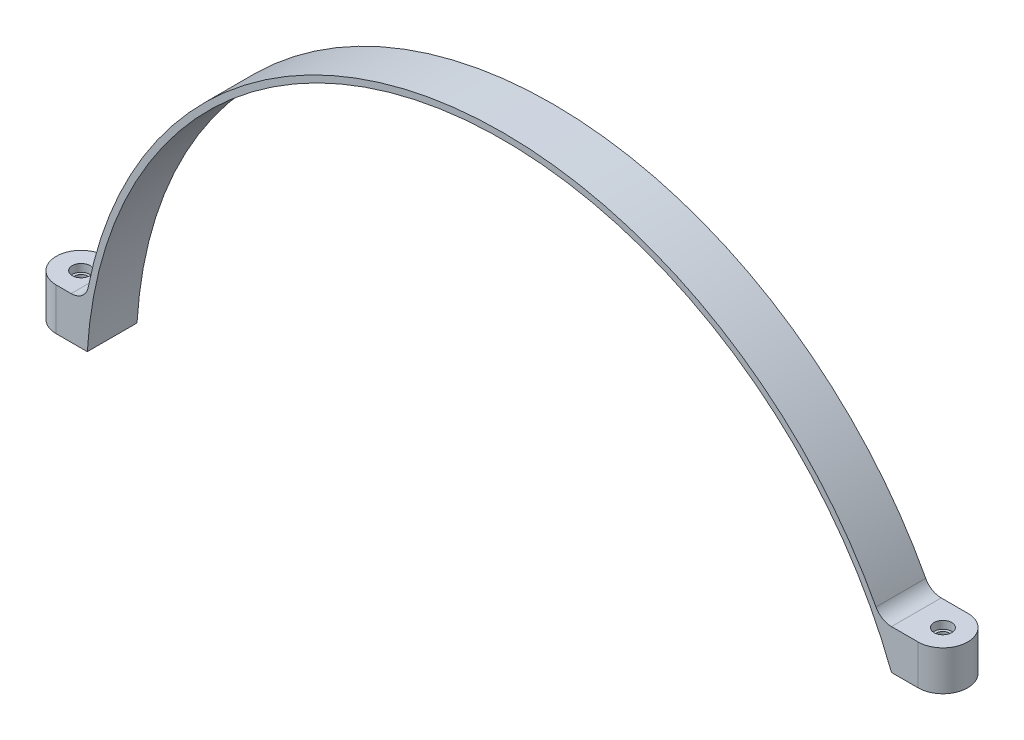
ISO-10303-21;
HEADER;
FILE_DESCRIPTION(('STEP AP214'),'2;1');
FILE_NAME('part.step','',(''),(''),'','','');
FILE_SCHEMA(('AUTOMOTIVE_DESIGN { 1 0 10303 214 1 1 1 1 }'));
ENDSEC;
DATA;
#1=APPLICATION_CONTEXT('core data for automotive mechanical design processes');
#2=APPLICATION_PROTOCOL_DEFINITION('international standard','automotive_design',2000,#1);
#3=PRODUCT_CONTEXT('',#1,'mechanical');
#4=PRODUCT('Part','Part','',(#3));
#5=PRODUCT_RELATED_PRODUCT_CATEGORY('part','',(#4));
#6=PRODUCT_DEFINITION_FORMATION('','',#4);
#7=PRODUCT_DEFINITION_CONTEXT('part definition',#1,'design');
#8=PRODUCT_DEFINITION('design','',#6,#7);
#9=PRODUCT_DEFINITION_SHAPE('','',#8);
#10=(LENGTH_UNIT() NAMED_UNIT(*) SI_UNIT(.MILLI.,.METRE.));
#11=(NAMED_UNIT(*) PLANE_ANGLE_UNIT() SI_UNIT($,.RADIAN.));
#12=(NAMED_UNIT(*) SI_UNIT($,.STERADIAN.) SOLID_ANGLE_UNIT());
#13=UNCERTAINTY_MEASURE_WITH_UNIT(LENGTH_MEASURE(1.E-05),#10,'distance_accuracy_value','');
#14=(GEOMETRIC_REPRESENTATION_CONTEXT(3) GLOBAL_UNCERTAINTY_ASSIGNED_CONTEXT((#13)) GLOBAL_UNIT_ASSIGNED_CONTEXT((#10,
#11,#12)) REPRESENTATION_CONTEXT('',''));
#15=CARTESIAN_POINT('',(0.,0.,0.));
#16=DIRECTION('',(0.,0.,1.));
#17=DIRECTION('',(1.,0.,0.));
#18=AXIS2_PLACEMENT_3D('',#15,#16,#17);
#19=CARTESIAN_POINT('',(167.08278072405,82.1,10.));
#20=DIRECTION('',(0.,-1.,0.));
#21=DIRECTION('',(0.,0.,-1.));
#22=AXIS2_PLACEMENT_3D('',#19,#20,#21);
#23=CYLINDRICAL_SURFACE('',#22,2.50000000000002);
#24=CARTESIAN_POINT('',(167.08278072405,60.,10.));
#25=DIRECTION('',(0.,-1.,0.));
#26=DIRECTION('',(0.,0.,-1.));
#27=AXIS2_PLACEMENT_3D('',#24,#25,#26);
#28=CIRCLE('',#27,2.50000000000002);
#29=CARTESIAN_POINT('',(167.08278072405,60.,7.49999999999998));
#30=VERTEX_POINT('',#29);
#31=EDGE_CURVE('E177',#30,#30,#28,.T.);
#32=ORIENTED_EDGE('',*,*,#31,.T.);
#33=EDGE_LOOP('',(#32));
#34=FACE_BOUND('',#33,.T.);
#35=CARTESIAN_POINT('',(167.08278072405,72.9,10.));
#36=DIRECTION('',(0.,1.,0.));
#37=DIRECTION('',(0.,0.,1.));
#38=AXIS2_PLACEMENT_3D('',#35,#36,#37);
#39=CIRCLE('',#38,2.50000000000002);
#40=CARTESIAN_POINT('',(167.08278072405,72.9,12.5));
#41=VERTEX_POINT('',#40);
#42=EDGE_CURVE('E45',#41,#41,#39,.F.);
#43=ORIENTED_EDGE('',*,*,#42,.F.);
#44=EDGE_LOOP('',(#43));
#45=FACE_BOUND('',#44,.T.);
#46=ADVANCED_FACE('F41',(#34,#45),#23,.F.);
#47=CARTESIAN_POINT('',(-179.705627484771,26.,10.));
#48=DIRECTION('',(0.,-1.,0.));
#49=DIRECTION('',(1.,0.,0.));
#50=AXIS2_PLACEMENT_3D('',#47,#48,#49);
#51=CYLINDRICAL_SURFACE('',#50,2.50000000000002);
#52=CARTESIAN_POINT('',(-179.705627484771,10.,10.));
#53=DIRECTION('',(0.,-1.,0.));
#54=DIRECTION('',(1.,0.,0.));
#55=AXIS2_PLACEMENT_3D('',#52,#53,#54);
#56=CIRCLE('',#55,2.50000000000002);
#57=CARTESIAN_POINT('',(-177.205627484771,10.,10.));
#58=VERTEX_POINT('',#57);
#59=EDGE_CURVE('E140',#58,#58,#56,.T.);
#60=ORIENTED_EDGE('',*,*,#59,.T.);
#61=EDGE_LOOP('',(#60));
#62=FACE_BOUND('',#61,.T.);
#63=CARTESIAN_POINT('',(-179.705627484771,23.9,10.));
#64=DIRECTION('',(0.,1.,0.));
#65=DIRECTION('',(-1.,0.,0.));
#66=AXIS2_PLACEMENT_3D('',#63,#64,#65);
#67=CIRCLE('',#66,2.50000000000002);
#68=CARTESIAN_POINT('',(-182.205627484771,23.9,10.));
#69=VERTEX_POINT('',#68);
#70=EDGE_CURVE('E160',#69,#69,#67,.F.);
#71=ORIENTED_EDGE('',*,*,#70,.F.);
#72=EDGE_LOOP('',(#71));
#73=FACE_BOUND('',#72,.T.);
#74=ADVANCED_FACE('F267',(#62,#73),#51,.F.);
#75=CARTESIAN_POINT('',(156.384941730334,60.,20.));
#76=DIRECTION('',(0.,1.,0.));
#77=DIRECTION('',(0.,0.,1.));
#78=AXIS2_PLACEMENT_3D('',#75,#76,#77);
#79=PLANE('',#78);
#80=ORIENTED_EDGE('',*,*,#31,.F.);
#81=EDGE_LOOP('',(#80));
#82=FACE_BOUND('',#81,.T.);
#83=DIRECTION('',(1.,0.,0.));
#84=VECTOR('',#83,1.);
#85=CARTESIAN_POINT('',(156.384941730334,60.,0.));
#86=LINE('',#85,#84);
#87=CARTESIAN_POINT('',(156.384941730334,60.,0.));
#88=VERTEX_POINT('',#87);
#89=CARTESIAN_POINT('',(167.08278072405,60.,0.));
#90=VERTEX_POINT('',#89);
#91=EDGE_CURVE('E197',#88,#90,#86,.T.);
#92=ORIENTED_EDGE('',*,*,#91,.T.);
#93=CARTESIAN_POINT('',(167.08278072405,60.,10.));
#94=DIRECTION('',(0.,1.,0.));
#95=DIRECTION('',(0.,0.,1.));
#96=AXIS2_PLACEMENT_3D('',#93,#94,#95);
#97=CIRCLE('',#96,10.);
#98=CARTESIAN_POINT('',(167.08278072405,60.,20.));
#99=VERTEX_POINT('',#98);
#100=EDGE_CURVE('E236',#90,#99,#97,.F.);
#101=ORIENTED_EDGE('',*,*,#100,.T.);
#102=DIRECTION('',(1.,0.,0.));
#103=VECTOR('',#102,1.);
#104=CARTESIAN_POINT('',(156.384941730334,60.,20.));
#105=LINE('',#104,#103);
#106=CARTESIAN_POINT('',(156.384941730334,60.,20.));
#107=VERTEX_POINT('',#106);
#108=EDGE_CURVE('E198',#107,#99,#105,.T.);
#109=ORIENTED_EDGE('',*,*,#108,.F.);
#110=DIRECTION('',(0.,0.,-1.));
#111=VECTOR('',#110,1.);
#112=CARTESIAN_POINT('',(156.384941730334,60.,20.));
#113=LINE('',#112,#111);
#114=EDGE_CURVE('E212',#107,#88,#113,.T.);
#115=ORIENTED_EDGE('',*,*,#114,.T.);
#116=EDGE_LOOP('',(#92,#101,#109,#115));
#117=FACE_BOUND('',#116,.T.);
#118=ADVANCED_FACE('F273',(#82,#117),#79,.F.);
#119=CARTESIAN_POINT('',(0.,0.,20.));
#120=DIRECTION('',(0.,0.,-1.));
#121=DIRECTION('',(-1.,0.,0.));
#122=AXIS2_PLACEMENT_3D('',#119,#120,#121);
#123=CYLINDRICAL_SURFACE('',#122,170.);
#124=CARTESIAN_POINT('',(0.,0.,0.));
#125=DIRECTION('',(0.,0.,1.));
#126=DIRECTION('',(1.,0.,0.));
#127=AXIS2_PLACEMENT_3D('',#124,#125,#126);
#128=CIRCLE('',#127,170.);
#129=CARTESIAN_POINT('',(150.150415787231,79.7173296022987,0.));
#130=VERTEX_POINT('',#129);
#131=CARTESIAN_POINT('',(-166.834130174155,32.6553672316384,0.));
#132=VERTEX_POINT('',#131);
#133=EDGE_CURVE('E216',#130,#132,#128,.T.);
#134=ORIENTED_EDGE('',*,*,#133,.T.);
#135=DIRECTION('',(0.,0.,-1.));
#136=VECTOR('',#135,1.);
#137=CARTESIAN_POINT('',(-166.834130174155,32.6553672316384,20.));
#138=LINE('',#137,#136);
#139=CARTESIAN_POINT('',(-166.834130174155,32.6553672316384,20.));
#140=VERTEX_POINT('',#139);
#141=EDGE_CURVE('E147',#132,#140,#138,.F.);
#142=ORIENTED_EDGE('',*,*,#141,.T.);
#143=CARTESIAN_POINT('',(0.,0.,20.));
#144=DIRECTION('',(0.,0.,1.));
#145=DIRECTION('',(1.,0.,0.));
#146=AXIS2_PLACEMENT_3D('',#143,#144,#145);
#147=CIRCLE('',#146,170.);
#148=CARTESIAN_POINT('',(150.150415787231,79.7173296022987,20.));
#149=VERTEX_POINT('',#148);
#150=EDGE_CURVE('E201',#149,#140,#147,.T.);
#151=ORIENTED_EDGE('',*,*,#150,.F.);
#152=DIRECTION('',(0.,0.,-1.));
#153=VECTOR('',#152,1.);
#154=CARTESIAN_POINT('',(150.150415787231,79.7173296022987,20.));
#155=LINE('',#154,#153);
#156=EDGE_CURVE('E145',#149,#130,#155,.T.);
#157=ORIENTED_EDGE('',*,*,#156,.T.);
#158=EDGE_LOOP('',(#134,#142,#151,#157));
#159=FACE_BOUND('',#158,.T.);
#160=ADVANCED_FACE('F252',(#159),#123,.T.);
#161=CARTESIAN_POINT('',(-189.705627484771,10.,20.));
#162=DIRECTION('',(0.,1.,0.));
#163=DIRECTION('',(-1.,0.,0.));
#164=AXIS2_PLACEMENT_3D('',#161,#162,#163);
#165=PLANE('',#164);
#166=ORIENTED_EDGE('',*,*,#59,.F.);
#167=EDGE_LOOP('',(#166));
#168=FACE_BOUND('',#167,.T.);
#169=CARTESIAN_POINT('',(-179.705627484771,10.,10.));
#170=DIRECTION('',(0.,1.,0.));
#171=DIRECTION('',(-1.,0.,0.));
#172=AXIS2_PLACEMENT_3D('',#169,#170,#171);
#173=CIRCLE('',#172,10.);
#174=CARTESIAN_POINT('',(-179.705627484771,10.,20.));
#175=VERTEX_POINT('',#174);
#176=CARTESIAN_POINT('',(-179.705627484771,10.,0.));
#177=VERTEX_POINT('',#176);
#178=EDGE_CURVE('E244',#175,#177,#173,.F.);
#179=ORIENTED_EDGE('',*,*,#178,.T.);
#180=DIRECTION('',(1.,0.,0.));
#181=VECTOR('',#180,1.);
#182=CARTESIAN_POINT('',(-189.705627484771,10.,0.));
#183=LINE('',#182,#181);
#184=CARTESIAN_POINT('',(-167.20122607206,10.,0.));
#185=VERTEX_POINT('',#184);
#186=EDGE_CURVE('E220',#177,#185,#183,.T.);
#187=ORIENTED_EDGE('',*,*,#186,.T.);
#188=DIRECTION('',(0.,0.,-1.));
#189=VECTOR('',#188,1.);
#190=CARTESIAN_POINT('',(-167.20122607206,10.,20.));
#191=LINE('',#190,#189);
#192=CARTESIAN_POINT('',(-167.20122607206,10.,20.));
#193=VERTEX_POINT('',#192);
#194=EDGE_CURVE('E228',#193,#185,#191,.T.);
#195=ORIENTED_EDGE('',*,*,#194,.F.);
#196=DIRECTION('',(1.,0.,0.));
#197=VECTOR('',#196,1.);
#198=CARTESIAN_POINT('',(-189.705627484771,10.,20.));
#199=LINE('',#198,#197);
#200=EDGE_CURVE('E205',#175,#193,#199,.T.);
#201=ORIENTED_EDGE('',*,*,#200,.F.);
#202=EDGE_LOOP('',(#179,#187,#195,#201));
#203=FACE_BOUND('',#202,.T.);
#204=ADVANCED_FACE('F302',(#168,#203),#165,.F.);
#205=CARTESIAN_POINT('',(0.,0.,20.));
#206=DIRECTION('',(0.,0.,-1.));
#207=DIRECTION('',(-1.,0.,0.));
#208=AXIS2_PLACEMENT_3D('',#205,#206,#207);
#209=CYLINDRICAL_SURFACE('',#208,167.5);
#210=CARTESIAN_POINT('',(0.,0.,0.));
#211=DIRECTION('',(0.,0.,1.));
#212=DIRECTION('',(1.,0.,0.));
#213=AXIS2_PLACEMENT_3D('',#210,#211,#212);
#214=CIRCLE('',#213,167.5);
#215=EDGE_CURVE('E202',#88,#185,#214,.T.);
#216=ORIENTED_EDGE('',*,*,#215,.F.);
#217=ORIENTED_EDGE('',*,*,#114,.F.);
#218=CARTESIAN_POINT('',(0.,0.,20.));
#219=DIRECTION('',(0.,0.,1.));
#220=DIRECTION('',(1.,0.,0.));
#221=AXIS2_PLACEMENT_3D('',#218,#219,#220);
#222=CIRCLE('',#221,167.5);
#223=EDGE_CURVE('E208',#107,#193,#222,.T.);
#224=ORIENTED_EDGE('',*,*,#223,.T.);
#225=ORIENTED_EDGE('',*,*,#194,.T.);
#226=EDGE_LOOP('',(#216,#217,#224,#225));
#227=FACE_BOUND('',#226,.T.);
#228=ADVANCED_FACE('F296',(#227),#209,.F.);
#229=CARTESIAN_POINT('',(0.,0.,20.));
#230=DIRECTION('',(0.,0.,1.));
#231=DIRECTION('',(1.,0.,0.));
#232=AXIS2_PLACEMENT_3D('',#229,#230,#231);
#233=PLANE('',#232);
#234=DIRECTION('',(0.,-1.,0.));
#235=VECTOR('',#234,1.);
#236=CARTESIAN_POINT('',(167.08278072405,0.,20.));
#237=LINE('',#236,#235);
#238=CARTESIAN_POINT('',(167.08278072405,76.,20.));
#239=VERTEX_POINT('',#238);
#240=EDGE_CURVE('E137',#99,#239,#237,.F.);
#241=ORIENTED_EDGE('',*,*,#240,.T.);
#242=DIRECTION('',(-1.,0.,0.));
#243=VECTOR('',#242,1.);
#244=CARTESIAN_POINT('',(156.384941730334,76.,20.));
#245=LINE('',#244,#243);
#246=CARTESIAN_POINT('',(156.384941730334,76.,20.));
#247=VERTEX_POINT('',#246);
#248=EDGE_CURVE('E125',#239,#247,#245,.T.);
#249=ORIENTED_EDGE('',*,*,#248,.T.);
#250=CARTESIAN_POINT('',(156.333079966706,82.9998078800404,20.));
#251=DIRECTION('',(0.,0.,1.));
#252=DIRECTION('',(1.,0.,0.));
#253=AXIS2_PLACEMENT_3D('',#250,#251,#252);
#254=CIRCLE('',#253,7.);
#255=EDGE_CURVE('E133',#247,#149,#254,.F.);
#256=ORIENTED_EDGE('',*,*,#255,.T.);
#257=ORIENTED_EDGE('',*,*,#150,.T.);
#258=CARTESIAN_POINT('',(-173.703770828385,34.,20.));
#259=DIRECTION('',(0.,0.,1.));
#260=DIRECTION('',(1.,0.,0.));
#261=AXIS2_PLACEMENT_3D('',#258,#259,#260);
#262=CIRCLE('',#261,7.);
#263=CARTESIAN_POINT('',(-173.703770828385,27.,20.));
#264=VERTEX_POINT('',#263);
#265=EDGE_CURVE('E51',#140,#264,#262,.F.);
#266=ORIENTED_EDGE('',*,*,#265,.T.);
#267=DIRECTION('',(-1.,0.,0.));
#268=VECTOR('',#267,1.);
#269=CARTESIAN_POINT('',(-179.705627484771,27.,20.));
#270=LINE('',#269,#268);
#271=CARTESIAN_POINT('',(-179.705627484771,27.,20.));
#272=VERTEX_POINT('',#271);
#273=EDGE_CURVE('E187',#264,#272,#270,.T.);
#274=ORIENTED_EDGE('',*,*,#273,.T.);
#275=DIRECTION('',(0.,1.,0.));
#276=VECTOR('',#275,1.);
#277=CARTESIAN_POINT('',(-179.705627484771,0.,20.));
#278=LINE('',#277,#276);
#279=EDGE_CURVE('E247',#272,#175,#278,.F.);
#280=ORIENTED_EDGE('',*,*,#279,.T.);
#281=ORIENTED_EDGE('',*,*,#200,.T.);
#282=ORIENTED_EDGE('',*,*,#223,.F.);
#283=ORIENTED_EDGE('',*,*,#108,.T.);
#284=EDGE_LOOP('',(#241,#249,#256,#257,#266,#274,#280,#281,#282,#283));
#285=FACE_BOUND('',#284,.T.);
#286=ADVANCED_FACE('F132',(#285),#233,.T.);
#287=CARTESIAN_POINT('',(0.,0.,0.));
#288=DIRECTION('',(0.,0.,1.));
#289=DIRECTION('',(1.,0.,0.));
#290=AXIS2_PLACEMENT_3D('',#287,#288,#289);
#291=PLANE('',#290);
#292=DIRECTION('',(1.,0.,0.));
#293=VECTOR('',#292,1.);
#294=CARTESIAN_POINT('',(156.384941730334,76.,0.));
#295=LINE('',#294,#293);
#296=CARTESIAN_POINT('',(156.384941730334,76.,0.));
#297=VERTEX_POINT('',#296);
#298=CARTESIAN_POINT('',(167.08278072405,76.,0.));
#299=VERTEX_POINT('',#298);
#300=EDGE_CURVE('E127',#297,#299,#295,.T.);
#301=ORIENTED_EDGE('',*,*,#300,.T.);
#302=DIRECTION('',(0.,-1.,0.));
#303=VECTOR('',#302,1.);
#304=CARTESIAN_POINT('',(167.08278072405,60.,0.));
#305=LINE('',#304,#303);
#306=EDGE_CURVE('E232',#299,#90,#305,.T.);
#307=ORIENTED_EDGE('',*,*,#306,.T.);
#308=ORIENTED_EDGE('',*,*,#91,.F.);
#309=ORIENTED_EDGE('',*,*,#215,.T.);
#310=ORIENTED_EDGE('',*,*,#186,.F.);
#311=DIRECTION('',(0.,1.,0.));
#312=VECTOR('',#311,1.);
#313=CARTESIAN_POINT('',(-179.705627484771,15.,0.));
#314=LINE('',#313,#312);
#315=CARTESIAN_POINT('',(-179.705627484771,27.,0.));
#316=VERTEX_POINT('',#315);
#317=EDGE_CURVE('E241',#177,#316,#314,.T.);
#318=ORIENTED_EDGE('',*,*,#317,.T.);
#319=DIRECTION('',(1.,0.,0.));
#320=VECTOR('',#319,1.);
#321=CARTESIAN_POINT('',(-179.705627484771,27.,0.));
#322=LINE('',#321,#320);
#323=CARTESIAN_POINT('',(-173.703770828385,27.,0.));
#324=VERTEX_POINT('',#323);
#325=EDGE_CURVE('E194',#316,#324,#322,.T.);
#326=ORIENTED_EDGE('',*,*,#325,.T.);
#327=CARTESIAN_POINT('',(-173.703770828385,34.,0.));
#328=DIRECTION('',(0.,0.,1.));
#329=DIRECTION('',(1.,0.,0.));
#330=AXIS2_PLACEMENT_3D('',#327,#328,#329);
#331=CIRCLE('',#330,7.);
#332=EDGE_CURVE('E11',#324,#132,#331,.T.);
#333=ORIENTED_EDGE('',*,*,#332,.T.);
#334=ORIENTED_EDGE('',*,*,#133,.F.);
#335=CARTESIAN_POINT('',(156.333079966706,82.9998078800404,0.));
#336=DIRECTION('',(0.,0.,1.));
#337=DIRECTION('',(1.,0.,0.));
#338=AXIS2_PLACEMENT_3D('',#335,#336,#337);
#339=CIRCLE('',#338,7.);
#340=EDGE_CURVE('E148',#130,#297,#339,.T.);
#341=ORIENTED_EDGE('',*,*,#340,.T.);
#342=EDGE_LOOP('',(#301,#307,#308,#309,#310,#318,#326,#333,#334,#341));
#343=FACE_BOUND('',#342,.T.);
#344=ADVANCED_FACE('F255',(#343),#291,.F.);
#345=CARTESIAN_POINT('',(167.08278072405,65.,10.));
#346=DIRECTION('',(0.,-1.,0.));
#347=DIRECTION('',(0.,0.,-1.));
#348=AXIS2_PLACEMENT_3D('',#345,#346,#347);
#349=CYLINDRICAL_SURFACE('',#348,10.);
#350=ORIENTED_EDGE('',*,*,#100,.F.);
#351=ORIENTED_EDGE('',*,*,#306,.F.);
#352=CARTESIAN_POINT('',(167.08278072405,76.,10.0000000000002));
#353=DIRECTION('',(0.,-1.,0.));
#354=DIRECTION('',(0.,0.,1.));
#355=AXIS2_PLACEMENT_3D('',#352,#353,#354);
#356=CIRCLE('',#355,10.0000000000002);
#357=EDGE_CURVE('E184',#299,#239,#356,.T.);
#358=ORIENTED_EDGE('',*,*,#357,.T.);
#359=ORIENTED_EDGE('',*,*,#240,.F.);
#360=EDGE_LOOP('',(#350,#351,#358,#359));
#361=FACE_BOUND('',#360,.T.);
#362=ADVANCED_FACE('F299',(#361),#349,.T.);
#363=CARTESIAN_POINT('',(-179.705627484771,10.,10.));
#364=DIRECTION('',(0.,1.,0.));
#365=DIRECTION('',(0.,0.,1.));
#366=AXIS2_PLACEMENT_3D('',#363,#364,#365);
#367=CYLINDRICAL_SURFACE('',#366,10.);
#368=ORIENTED_EDGE('',*,*,#317,.F.);
#369=ORIENTED_EDGE('',*,*,#178,.F.);
#370=ORIENTED_EDGE('',*,*,#279,.F.);
#371=CARTESIAN_POINT('',(-179.705627484771,27.,10.));
#372=DIRECTION('',(0.,-1.,0.));
#373=DIRECTION('',(-1.,0.,0.));
#374=AXIS2_PLACEMENT_3D('',#371,#372,#373);
#375=CIRCLE('',#374,9.99999999999995);
#376=EDGE_CURVE('E190',#272,#316,#375,.T.);
#377=ORIENTED_EDGE('',*,*,#376,.T.);
#378=EDGE_LOOP('',(#368,#369,#370,#377));
#379=FACE_BOUND('',#378,.T.);
#380=ADVANCED_FACE('F292',(#379),#367,.T.);
#381=CARTESIAN_POINT('',(-179.705627484771,27.,10.));
#382=DIRECTION('',(0.,1.,0.));
#383=DIRECTION('',(-1.,0.,0.));
#384=AXIS2_PLACEMENT_3D('',#381,#382,#383);
#385=PLANE('',#384);
#386=CARTESIAN_POINT('',(-179.705627484771,27.,10.));
#387=DIRECTION('',(0.,1.,0.));
#388=DIRECTION('',(-1.,0.,0.));
#389=AXIS2_PLACEMENT_3D('',#386,#387,#388);
#390=CIRCLE('',#389,3.55000000000002);
#391=CARTESIAN_POINT('',(-183.255627484771,27.,10.));
#392=VERTEX_POINT('',#391);
#393=EDGE_CURVE('E171',#392,#392,#390,.T.);
#394=ORIENTED_EDGE('',*,*,#393,.F.);
#395=EDGE_LOOP('',(#394));
#396=FACE_BOUND('',#395,.T.);
#397=ORIENTED_EDGE('',*,*,#273,.F.);
#398=DIRECTION('',(0.,0.,-1.));
#399=VECTOR('',#398,1.);
#400=CARTESIAN_POINT('',(-173.703770828385,27.,10.));
#401=LINE('',#400,#399);
#402=EDGE_CURVE('E65',#264,#324,#401,.T.);
#403=ORIENTED_EDGE('',*,*,#402,.T.);
#404=ORIENTED_EDGE('',*,*,#325,.F.);
#405=ORIENTED_EDGE('',*,*,#376,.F.);
#406=EDGE_LOOP('',(#397,#403,#404,#405));
#407=FACE_BOUND('',#406,.T.);
#408=ADVANCED_FACE('F288',(#396,#407),#385,.T.);
#409=CARTESIAN_POINT('',(167.08278072405,76.,9.99999999999999));
#410=DIRECTION('',(0.,1.,0.));
#411=DIRECTION('',(0.,0.,1.));
#412=AXIS2_PLACEMENT_3D('',#409,#410,#411);
#413=PLANE('',#412);
#414=CARTESIAN_POINT('',(167.08278072405,76.,10.));
#415=DIRECTION('',(0.,1.,0.));
#416=DIRECTION('',(0.,0.,1.));
#417=AXIS2_PLACEMENT_3D('',#414,#415,#416);
#418=CIRCLE('',#417,3.55000000000002);
#419=CARTESIAN_POINT('',(167.08278072405,76.,13.55));
#420=VERTEX_POINT('',#419);
#421=EDGE_CURVE('E437',#420,#420,#418,.T.);
#422=ORIENTED_EDGE('',*,*,#421,.F.);
#423=EDGE_LOOP('',(#422));
#424=FACE_BOUND('',#423,.T.);
#425=ORIENTED_EDGE('',*,*,#248,.F.);
#426=ORIENTED_EDGE('',*,*,#357,.F.);
#427=ORIENTED_EDGE('',*,*,#300,.F.);
#428=DIRECTION('',(0.,0.,-1.));
#429=VECTOR('',#428,1.);
#430=CARTESIAN_POINT('',(156.384941730334,76.,20.));
#431=LINE('',#430,#429);
#432=EDGE_CURVE('E121',#247,#297,#431,.T.);
#433=ORIENTED_EDGE('',*,*,#432,.F.);
#434=EDGE_LOOP('',(#425,#426,#427,#433));
#435=FACE_BOUND('',#434,.T.);
#436=ADVANCED_FACE('F123',(#424,#435),#413,.T.);
#437=CARTESIAN_POINT('',(156.333079966706,82.9998078800404,20.));
#438=DIRECTION('',(0.,0.,1.));
#439=DIRECTION('',(1.,0.,0.));
#440=AXIS2_PLACEMENT_3D('',#437,#438,#439);
#441=CYLINDRICAL_SURFACE('',#440,7.);
#442=ORIENTED_EDGE('',*,*,#255,.F.);
#443=ORIENTED_EDGE('',*,*,#432,.T.);
#444=ORIENTED_EDGE('',*,*,#340,.F.);
#445=ORIENTED_EDGE('',*,*,#156,.F.);
#446=EDGE_LOOP('',(#442,#443,#444,#445));
#447=FACE_BOUND('',#446,.T.);
#448=ADVANCED_FACE('F143',(#447),#441,.F.);
#449=CARTESIAN_POINT('',(-173.703770828385,34.,20.));
#450=DIRECTION('',(0.,0.,-1.));
#451=DIRECTION('',(-1.,0.,0.));
#452=AXIS2_PLACEMENT_3D('',#449,#450,#451);
#453=CYLINDRICAL_SURFACE('',#452,7.);
#454=ORIENTED_EDGE('',*,*,#332,.F.);
#455=ORIENTED_EDGE('',*,*,#402,.F.);
#456=ORIENTED_EDGE('',*,*,#265,.F.);
#457=ORIENTED_EDGE('',*,*,#141,.F.);
#458=EDGE_LOOP('',(#454,#455,#456,#457));
#459=FACE_BOUND('',#458,.T.);
#460=ADVANCED_FACE('F43',(#459),#453,.F.);
#461=CARTESIAN_POINT('',(-179.705627484771,23.9,10.));
#462=DIRECTION('',(0.,1.,0.));
#463=DIRECTION('',(-1.,0.,0.));
#464=AXIS2_PLACEMENT_3D('',#461,#462,#463);
#465=PLANE('',#464);
#466=CARTESIAN_POINT('',(-179.705627484771,23.9,10.));
#467=DIRECTION('',(0.,1.,0.));
#468=DIRECTION('',(-1.,0.,0.));
#469=AXIS2_PLACEMENT_3D('',#466,#467,#468);
#470=CIRCLE('',#469,3.55000000000002);
#471=CARTESIAN_POINT('',(-183.255627484771,23.9,10.));
#472=VERTEX_POINT('',#471);
#473=EDGE_CURVE('E163',#472,#472,#470,.T.);
#474=ORIENTED_EDGE('',*,*,#473,.T.);
#475=EDGE_LOOP('',(#474));
#476=FACE_BOUND('',#475,.T.);
#477=ORIENTED_EDGE('',*,*,#70,.T.);
#478=EDGE_LOOP('',(#477));
#479=FACE_BOUND('',#478,.T.);
#480=ADVANCED_FACE('F259',(#476,#479),#465,.T.);
#481=CARTESIAN_POINT('',(-179.705627484771,23.9,10.));
#482=DIRECTION('',(0.,1.,0.));
#483=DIRECTION('',(-1.,0.,0.));
#484=AXIS2_PLACEMENT_3D('',#481,#482,#483);
#485=CYLINDRICAL_SURFACE('',#484,3.55000000000002);
#486=CARTESIAN_POINT('',(-183.255627484771,23.9,10.));
#487=CARTESIAN_POINT('',(-183.255627484771,23.9322916666667,10.));
#488=CARTESIAN_POINT('',(-183.255627484771,23.9645833333333,10.));
#489=CARTESIAN_POINT('',(-183.255627484771,24.0291666666667,10.));
#490=CARTESIAN_POINT('',(-183.255627484771,24.0614583333333,10.));
#491=CARTESIAN_POINT('',(-183.255627484771,24.1260416666667,10.));
#492=CARTESIAN_POINT('',(-183.255627484771,24.1583333333333,10.));
#493=CARTESIAN_POINT('',(-183.255627484771,24.2229166666667,10.));
#494=CARTESIAN_POINT('',(-183.255627484771,24.2552083333333,10.));
#495=CARTESIAN_POINT('',(-183.255627484771,24.3197916666667,10.));
#496=CARTESIAN_POINT('',(-183.255627484771,24.3520833333333,10.));
#497=CARTESIAN_POINT('',(-183.255627484771,24.4166666666667,10.));
#498=CARTESIAN_POINT('',(-183.255627484771,24.4489583333333,10.));
#499=CARTESIAN_POINT('',(-183.255627484771,24.5135416666667,10.));
#500=CARTESIAN_POINT('',(-183.255627484771,24.5458333333333,10.));
#501=CARTESIAN_POINT('',(-183.255627484771,24.6104166666667,10.));
#502=CARTESIAN_POINT('',(-183.255627484771,24.6427083333333,10.));
#503=CARTESIAN_POINT('',(-183.255627484771,24.7072916666667,10.));
#504=CARTESIAN_POINT('',(-183.255627484771,24.7395833333333,10.));
#505=CARTESIAN_POINT('',(-183.255627484771,24.8041666666667,10.));
#506=CARTESIAN_POINT('',(-183.255627484771,24.8364583333333,10.));
#507=CARTESIAN_POINT('',(-183.255627484771,24.9010416666667,10.));
#508=CARTESIAN_POINT('',(-183.255627484771,24.9333333333333,10.));
#509=CARTESIAN_POINT('',(-183.255627484771,24.9979166666667,10.));
#510=CARTESIAN_POINT('',(-183.255627484771,25.0302083333333,10.));
#511=CARTESIAN_POINT('',(-183.255627484771,25.0947916666667,10.));
#512=CARTESIAN_POINT('',(-183.255627484771,25.1270833333333,10.));
#513=CARTESIAN_POINT('',(-183.255627484771,25.1916666666667,10.));
#514=CARTESIAN_POINT('',(-183.255627484771,25.2239583333333,10.));
#515=CARTESIAN_POINT('',(-183.255627484771,25.2885416666667,10.));
#516=CARTESIAN_POINT('',(-183.255627484771,25.3208333333333,10.));
#517=CARTESIAN_POINT('',(-183.255627484771,25.3854166666667,10.));
#518=CARTESIAN_POINT('',(-183.255627484771,25.4177083333333,10.));
#519=CARTESIAN_POINT('',(-183.255627484771,25.4822916666667,10.));
#520=CARTESIAN_POINT('',(-183.255627484771,25.5145833333333,10.));
#521=CARTESIAN_POINT('',(-183.255627484771,25.5791666666667,10.));
#522=CARTESIAN_POINT('',(-183.255627484771,25.6114583333333,10.));
#523=CARTESIAN_POINT('',(-183.255627484771,25.6760416666667,10.));
#524=CARTESIAN_POINT('',(-183.255627484771,25.7083333333333,10.));
#525=CARTESIAN_POINT('',(-183.255627484771,25.7729166666667,10.));
#526=CARTESIAN_POINT('',(-183.255627484771,25.8052083333333,10.));
#527=CARTESIAN_POINT('',(-183.255627484771,25.8697916666667,10.));
#528=CARTESIAN_POINT('',(-183.255627484771,25.9020833333333,10.));
#529=CARTESIAN_POINT('',(-183.255627484771,25.9666666666667,10.));
#530=CARTESIAN_POINT('',(-183.255627484771,25.9989583333333,10.));
#531=CARTESIAN_POINT('',(-183.255627484771,26.0635416666667,10.));
#532=CARTESIAN_POINT('',(-183.255627484771,26.0958333333333,10.));
#533=CARTESIAN_POINT('',(-183.255627484771,26.1604166666667,10.));
#534=CARTESIAN_POINT('',(-183.255627484771,26.1927083333333,10.));
#535=CARTESIAN_POINT('',(-183.255627484771,26.2572916666667,10.));
#536=CARTESIAN_POINT('',(-183.255627484771,26.2895833333333,10.));
#537=CARTESIAN_POINT('',(-183.255627484771,26.3541666666667,10.));
#538=CARTESIAN_POINT('',(-183.255627484771,26.3864583333333,10.));
#539=CARTESIAN_POINT('',(-183.255627484771,26.4510416666667,10.));
#540=CARTESIAN_POINT('',(-183.255627484771,26.4833333333333,10.));
#541=CARTESIAN_POINT('',(-183.255627484771,26.5479166666667,10.));
#542=CARTESIAN_POINT('',(-183.255627484771,26.5802083333333,10.));
#543=CARTESIAN_POINT('',(-183.255627484771,26.6447916666667,10.));
#544=CARTESIAN_POINT('',(-183.255627484771,26.6770833333333,10.));
#545=CARTESIAN_POINT('',(-183.255627484771,26.7416666666667,10.));
#546=CARTESIAN_POINT('',(-183.255627484771,26.7739583333333,10.));
#547=CARTESIAN_POINT('',(-183.255627484771,26.8385416666667,10.));
#548=CARTESIAN_POINT('',(-183.255627484771,26.8708333333333,10.));
#549=CARTESIAN_POINT('',(-183.255627484771,26.9354166666667,10.));
#550=CARTESIAN_POINT('',(-183.255627484771,26.9677083333333,10.));
#551=CARTESIAN_POINT('',(-183.255627484771,27.,10.));
#552=B_SPLINE_CURVE_WITH_KNOTS('',3,(#486,#487,#488,#489,#490,#491,#492,#493,#494,#495,#496,
#497,#498,#499,#500,#501,#502,#503,#504,#505,#506,#507,#508,#509,#510,#511,#512,#513,#514,#515,
#516,#517,#518,#519,#520,#521,#522,#523,#524,#525,#526,#527,#528,#529,#530,#531,#532,#533,#534,
#535,#536,#537,#538,#539,#540,#541,#542,#543,#544,#545,#546,#547,#548,#549,#550,#551),
.UNSPECIFIED.,.F.,.F.,(4,2,2,2,2,2,2,2,2,2,2,2,2,2,2,2,2,2,2,2,2,2,2,2,2,2,2,2,2,2,2,2,4),(0.,
0.0968749999999997,0.193749999999999,0.290624999999999,0.387499999999999,0.484374999999999,
0.581249999999998,0.678124999999998,0.774999999999998,0.871874999999998,0.968749999999997,
1.065625,1.1625,1.259375,1.35625,1.453125,1.55,1.646875,1.74375,1.840625,1.9375,2.034375,
2.13125,2.228125,2.325,2.421875,2.51875,2.615625,2.7125,2.809375,2.90625,3.003125,3.1),.UNSPECIFIED.);
#553=EDGE_CURVE('BSEAM264',#472,#392,#552,.T.);
#554=ORIENTED_EDGE('',*,*,#473,.F.);
#555=ORIENTED_EDGE('',*,*,#393,.T.);
#556=ORIENTED_EDGE('',*,*,#553,.T.);
#557=ORIENTED_EDGE('',*,*,#553,.F.);
#558=EDGE_LOOP('',(#554,#556,#555,#557));
#559=FACE_BOUND('',#558,.T.);
#560=ADVANCED_FACE('F264',(#559),#485,.F.);
#561=CARTESIAN_POINT('',(167.08278072405,72.9,10.));
#562=DIRECTION('',(0.,1.,0.));
#563=DIRECTION('',(0.,0.,1.));
#564=AXIS2_PLACEMENT_3D('',#561,#562,#563);
#565=PLANE('',#564);
#566=CARTESIAN_POINT('',(167.08278072405,72.9,10.));
#567=DIRECTION('',(0.,1.,0.));
#568=DIRECTION('',(0.,0.,1.));
#569=AXIS2_PLACEMENT_3D('',#566,#567,#568);
#570=CIRCLE('',#569,3.55000000000002);
#571=CARTESIAN_POINT('',(167.08278072405,72.9,13.55));
#572=VERTEX_POINT('',#571);
#573=EDGE_CURVE('E434',#572,#572,#570,.T.);
#574=ORIENTED_EDGE('',*,*,#573,.T.);
#575=EDGE_LOOP('',(#574));
#576=FACE_BOUND('',#575,.T.);
#577=ORIENTED_EDGE('',*,*,#42,.T.);
#578=EDGE_LOOP('',(#577));
#579=FACE_BOUND('',#578,.T.);
#580=ADVANCED_FACE('F283',(#576,#579),#565,.T.);
#581=CARTESIAN_POINT('',(167.08278072405,72.9,10.));
#582=DIRECTION('',(0.,1.,0.));
#583=DIRECTION('',(0.,0.,1.));
#584=AXIS2_PLACEMENT_3D('',#581,#582,#583);
#585=CYLINDRICAL_SURFACE('',#584,3.55000000000002);
#586=CARTESIAN_POINT('',(167.08278072405,72.9,13.55));
#587=CARTESIAN_POINT('',(167.08278072405,72.9322916666667,13.55));
#588=CARTESIAN_POINT('',(167.08278072405,72.9645833333333,13.55));
#589=CARTESIAN_POINT('',(167.08278072405,73.0291666666667,13.55));
#590=CARTESIAN_POINT('',(167.08278072405,73.0614583333333,13.55));
#591=CARTESIAN_POINT('',(167.08278072405,73.1260416666667,13.55));
#592=CARTESIAN_POINT('',(167.08278072405,73.1583333333333,13.55));
#593=CARTESIAN_POINT('',(167.08278072405,73.2229166666667,13.55));
#594=CARTESIAN_POINT('',(167.08278072405,73.2552083333333,13.55));
#595=CARTESIAN_POINT('',(167.08278072405,73.3197916666667,13.55));
#596=CARTESIAN_POINT('',(167.08278072405,73.3520833333333,13.55));
#597=CARTESIAN_POINT('',(167.08278072405,73.4166666666667,13.55));
#598=CARTESIAN_POINT('',(167.08278072405,73.4489583333333,13.55));
#599=CARTESIAN_POINT('',(167.08278072405,73.5135416666667,13.55));
#600=CARTESIAN_POINT('',(167.08278072405,73.5458333333333,13.55));
#601=CARTESIAN_POINT('',(167.08278072405,73.6104166666667,13.55));
#602=CARTESIAN_POINT('',(167.08278072405,73.6427083333333,13.55));
#603=CARTESIAN_POINT('',(167.08278072405,73.7072916666667,13.55));
#604=CARTESIAN_POINT('',(167.08278072405,73.7395833333333,13.55));
#605=CARTESIAN_POINT('',(167.08278072405,73.8041666666667,13.55));
#606=CARTESIAN_POINT('',(167.08278072405,73.8364583333333,13.55));
#607=CARTESIAN_POINT('',(167.08278072405,73.9010416666667,13.55));
#608=CARTESIAN_POINT('',(167.08278072405,73.9333333333333,13.55));
#609=CARTESIAN_POINT('',(167.08278072405,73.9979166666667,13.55));
#610=CARTESIAN_POINT('',(167.08278072405,74.0302083333333,13.55));
#611=CARTESIAN_POINT('',(167.08278072405,74.0947916666667,13.55));
#612=CARTESIAN_POINT('',(167.08278072405,74.1270833333333,13.55));
#613=CARTESIAN_POINT('',(167.08278072405,74.1916666666667,13.55));
#614=CARTESIAN_POINT('',(167.08278072405,74.2239583333333,13.55));
#615=CARTESIAN_POINT('',(167.08278072405,74.2885416666667,13.55));
#616=CARTESIAN_POINT('',(167.08278072405,74.3208333333333,13.55));
#617=CARTESIAN_POINT('',(167.08278072405,74.3854166666667,13.55));
#618=CARTESIAN_POINT('',(167.08278072405,74.4177083333333,13.55));
#619=CARTESIAN_POINT('',(167.08278072405,74.4822916666667,13.55));
#620=CARTESIAN_POINT('',(167.08278072405,74.5145833333333,13.55));
#621=CARTESIAN_POINT('',(167.08278072405,74.5791666666667,13.55));
#622=CARTESIAN_POINT('',(167.08278072405,74.6114583333333,13.55));
#623=CARTESIAN_POINT('',(167.08278072405,74.6760416666667,13.55));
#624=CARTESIAN_POINT('',(167.08278072405,74.7083333333333,13.55));
#625=CARTESIAN_POINT('',(167.08278072405,74.7729166666667,13.55));
#626=CARTESIAN_POINT('',(167.08278072405,74.8052083333333,13.55));
#627=CARTESIAN_POINT('',(167.08278072405,74.8697916666667,13.55));
#628=CARTESIAN_POINT('',(167.08278072405,74.9020833333333,13.55));
#629=CARTESIAN_POINT('',(167.08278072405,74.9666666666667,13.55));
#630=CARTESIAN_POINT('',(167.08278072405,74.9989583333333,13.55));
#631=CARTESIAN_POINT('',(167.08278072405,75.0635416666667,13.55));
#632=CARTESIAN_POINT('',(167.08278072405,75.0958333333333,13.55));
#633=CARTESIAN_POINT('',(167.08278072405,75.1604166666667,13.55));
#634=CARTESIAN_POINT('',(167.08278072405,75.1927083333333,13.55));
#635=CARTESIAN_POINT('',(167.08278072405,75.2572916666667,13.55));
#636=CARTESIAN_POINT('',(167.08278072405,75.2895833333333,13.55));
#637=CARTESIAN_POINT('',(167.08278072405,75.3541666666667,13.55));
#638=CARTESIAN_POINT('',(167.08278072405,75.3864583333333,13.55));
#639=CARTESIAN_POINT('',(167.08278072405,75.4510416666667,13.55));
#640=CARTESIAN_POINT('',(167.08278072405,75.4833333333333,13.55));
#641=CARTESIAN_POINT('',(167.08278072405,75.5479166666667,13.55));
#642=CARTESIAN_POINT('',(167.08278072405,75.5802083333333,13.55));
#643=CARTESIAN_POINT('',(167.08278072405,75.6447916666667,13.55));
#644=CARTESIAN_POINT('',(167.08278072405,75.6770833333333,13.55));
#645=CARTESIAN_POINT('',(167.08278072405,75.7416666666667,13.55));
#646=CARTESIAN_POINT('',(167.08278072405,75.7739583333333,13.55));
#647=CARTESIAN_POINT('',(167.08278072405,75.8385416666667,13.55));
#648=CARTESIAN_POINT('',(167.08278072405,75.8708333333333,13.55));
#649=CARTESIAN_POINT('',(167.08278072405,75.9354166666667,13.55));
#650=CARTESIAN_POINT('',(167.08278072405,75.9677083333333,13.55));
#651=CARTESIAN_POINT('',(167.08278072405,76.,13.55));
#652=B_SPLINE_CURVE_WITH_KNOTS('',3,(#586,#587,#588,#589,#590,#591,#592,#593,#594,#595,#596,
#597,#598,#599,#600,#601,#602,#603,#604,#605,#606,#607,#608,#609,#610,#611,#612,#613,#614,#615,
#616,#617,#618,#619,#620,#621,#622,#623,#624,#625,#626,#627,#628,#629,#630,#631,#632,#633,#634,
#635,#636,#637,#638,#639,#640,#641,#642,#643,#644,#645,#646,#647,#648,#649,#650,#651),
.UNSPECIFIED.,.F.,.F.,(4,2,2,2,2,2,2,2,2,2,2,2,2,2,2,2,2,2,2,2,2,2,2,2,2,2,2,2,2,2,2,2,4),(0.,
0.0968750000000101,0.193750000000006,0.290625000000003,0.387500000000013,0.484375000000009,
0.581250000000005,0.678125000000002,0.775000000000012,0.871875000000008,0.968750000000004,
1.06562500000001,1.16250000000001,1.25937500000001,1.35625,1.45312500000001,1.55000000000001,
1.64687500000001,1.74375000000002,1.84062500000001,1.93750000000001,2.03437500000001,
2.13125000000002,2.22812500000001,2.32500000000001,2.42187500000002,2.51875000000001,
2.61562500000001,2.71250000000001,2.80937500000002,2.90625000000001,3.00312500000001,
3.10000000000001),.UNSPECIFIED.);
#653=EDGE_CURVE('BSEAM279',#572,#420,#652,.T.);
#654=ORIENTED_EDGE('',*,*,#573,.F.);
#655=ORIENTED_EDGE('',*,*,#421,.T.);
#656=ORIENTED_EDGE('',*,*,#653,.T.);
#657=ORIENTED_EDGE('',*,*,#653,.F.);
#658=EDGE_LOOP('',(#654,#656,#655,#657));
#659=FACE_BOUND('',#658,.T.);
#660=ADVANCED_FACE('F279',(#659),#585,.F.);
#661=CLOSED_SHELL('',(#46,#74,#118,#160,#204,#228,#286,#344,#362,#380,#408,#436,#448,#460,#480,
#560,#580,#660));
#662=MANIFOLD_SOLID_BREP('B2',#661);
#663=ADVANCED_BREP_SHAPE_REPRESENTATION('',(#18,#662),#14);
#664=SHAPE_DEFINITION_REPRESENTATION(#9,#663);
ENDSEC;
END-ISO-10303-21;
